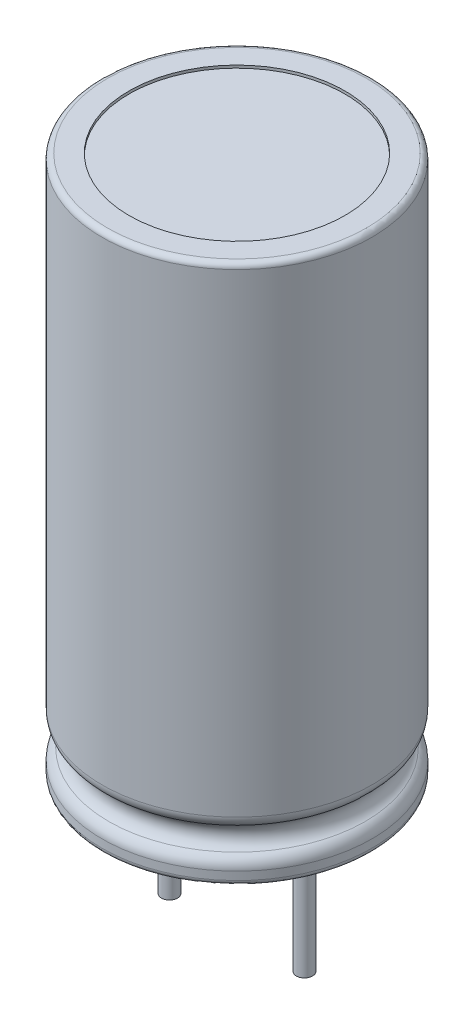
ISO-10303-21;
HEADER;
FILE_DESCRIPTION(('STEP AP214'),'2;1');
FILE_NAME('part.step','',(''),(''),'','','');
FILE_SCHEMA(('AUTOMOTIVE_DESIGN { 1 0 10303 214 1 1 1 1 }'));
ENDSEC;
DATA;
#1=APPLICATION_CONTEXT('core data for automotive mechanical design processes');
#2=APPLICATION_PROTOCOL_DEFINITION('international standard','automotive_design',2000,#1);
#3=PRODUCT_CONTEXT('',#1,'mechanical');
#4=PRODUCT('Part','Part','',(#3));
#5=PRODUCT_RELATED_PRODUCT_CATEGORY('part','',(#4));
#6=PRODUCT_DEFINITION_FORMATION('','',#4);
#7=PRODUCT_DEFINITION_CONTEXT('part definition',#1,'design');
#8=PRODUCT_DEFINITION('design','',#6,#7);
#9=PRODUCT_DEFINITION_SHAPE('','',#8);
#10=(LENGTH_UNIT() NAMED_UNIT(*) SI_UNIT(.MILLI.,.METRE.));
#11=(NAMED_UNIT(*) PLANE_ANGLE_UNIT() SI_UNIT($,.RADIAN.));
#12=(NAMED_UNIT(*) SI_UNIT($,.STERADIAN.) SOLID_ANGLE_UNIT());
#13=UNCERTAINTY_MEASURE_WITH_UNIT(LENGTH_MEASURE(1.E-05),#10,'distance_accuracy_value','');
#14=(GEOMETRIC_REPRESENTATION_CONTEXT(3) GLOBAL_UNCERTAINTY_ASSIGNED_CONTEXT((#13)) GLOBAL_UNIT_ASSIGNED_CONTEXT((#10,
#11,#12)) REPRESENTATION_CONTEXT('',''));
#15=CARTESIAN_POINT('',(0.,0.,0.));
#16=DIRECTION('',(0.,0.,1.));
#17=DIRECTION('',(1.,0.,0.));
#18=AXIS2_PLACEMENT_3D('',#15,#16,#17);
#19=CARTESIAN_POINT('',(2.5,-5.,0.));
#20=DIRECTION('',(0.,1.,0.));
#21=DIRECTION('',(0.,0.,1.));
#22=AXIS2_PLACEMENT_3D('',#19,#20,#21);
#23=CYLINDRICAL_SURFACE('',#22,0.3);
#24=CARTESIAN_POINT('',(2.5,-5.,0.));
#25=DIRECTION('',(0.,-1.,0.));
#26=DIRECTION('',(0.,0.,-1.));
#27=AXIS2_PLACEMENT_3D('',#24,#25,#26);
#28=CIRCLE('',#27,0.3);
#29=CARTESIAN_POINT('',(2.5,-5.,-0.299999999999999));
#30=VERTEX_POINT('',#29);
#31=EDGE_CURVE('E11',#30,#30,#28,.T.);
#32=ORIENTED_EDGE('',*,*,#31,.F.);
#33=EDGE_LOOP('',(#32));
#34=FACE_BOUND('',#33,.T.);
#35=CARTESIAN_POINT('',(2.5,5.,0.));
#36=DIRECTION('',(0.,-1.,0.));
#37=DIRECTION('',(0.,0.,-1.));
#38=AXIS2_PLACEMENT_3D('',#35,#36,#37);
#39=CIRCLE('',#38,0.3);
#40=CARTESIAN_POINT('',(2.5,5.,-0.299999999999999));
#41=VERTEX_POINT('',#40);
#42=EDGE_CURVE('E43',#41,#41,#39,.T.);
#43=ORIENTED_EDGE('',*,*,#42,.T.);
#44=EDGE_LOOP('',(#43));
#45=FACE_BOUND('',#44,.T.);
#46=ADVANCED_FACE('F40',(#34,#45),#23,.T.);
#47=CARTESIAN_POINT('',(2.5,-5.,0.));
#48=DIRECTION('',(0.,-1.,0.));
#49=DIRECTION('',(0.,0.,-1.));
#50=AXIS2_PLACEMENT_3D('',#47,#48,#49);
#51=PLANE('',#50);
#52=ORIENTED_EDGE('',*,*,#31,.T.);
#53=EDGE_LOOP('',(#52));
#54=FACE_BOUND('',#53,.T.);
#55=ADVANCED_FACE('F55',(#54),#51,.T.);
#56=CARTESIAN_POINT('',(2.5,5.,0.));
#57=DIRECTION('',(0.,-1.,0.));
#58=DIRECTION('',(0.,0.,-1.));
#59=AXIS2_PLACEMENT_3D('',#56,#57,#58);
#60=PLANE('',#59);
#61=ORIENTED_EDGE('',*,*,#42,.F.);
#62=EDGE_LOOP('',(#61));
#63=FACE_BOUND('',#62,.T.);
#64=ADVANCED_FACE('F53',(#63),#60,.F.);
#65=CLOSED_SHELL('',(#46,#55,#64));
#66=MANIFOLD_SOLID_BREP('B2',#65);
#67=CARTESIAN_POINT('',(-2.5,-5.,0.));
#68=DIRECTION('',(0.,1.,0.));
#69=DIRECTION('',(0.,0.,1.));
#70=AXIS2_PLACEMENT_3D('',#67,#68,#69);
#71=CYLINDRICAL_SURFACE('',#70,0.3);
#72=CARTESIAN_POINT('',(-2.5,-5.,0.));
#73=DIRECTION('',(0.,-1.,0.));
#74=DIRECTION('',(0.,0.,-1.));
#75=AXIS2_PLACEMENT_3D('',#72,#73,#74);
#76=CIRCLE('',#75,0.3);
#77=CARTESIAN_POINT('',(-2.5,-5.,-0.300000000000001));
#78=VERTEX_POINT('',#77);
#79=EDGE_CURVE('E39',#78,#78,#76,.T.);
#80=ORIENTED_EDGE('',*,*,#79,.F.);
#81=EDGE_LOOP('',(#80));
#82=FACE_BOUND('',#81,.T.);
#83=CARTESIAN_POINT('',(-2.5,5.,0.));
#84=DIRECTION('',(0.,-1.,0.));
#85=DIRECTION('',(0.,0.,-1.));
#86=AXIS2_PLACEMENT_3D('',#83,#84,#85);
#87=CIRCLE('',#86,0.3);
#88=CARTESIAN_POINT('',(-2.5,5.,-0.300000000000001));
#89=VERTEX_POINT('',#88);
#90=EDGE_CURVE('E91',#89,#89,#87,.T.);
#91=ORIENTED_EDGE('',*,*,#90,.T.);
#92=EDGE_LOOP('',(#91));
#93=FACE_BOUND('',#92,.T.);
#94=ADVANCED_FACE('F88',(#82,#93),#71,.T.);
#95=CARTESIAN_POINT('',(-2.5,-5.,0.));
#96=DIRECTION('',(0.,-1.,0.));
#97=DIRECTION('',(0.,0.,-1.));
#98=AXIS2_PLACEMENT_3D('',#95,#96,#97);
#99=PLANE('',#98);
#100=ORIENTED_EDGE('',*,*,#79,.T.);
#101=EDGE_LOOP('',(#100));
#102=FACE_BOUND('',#101,.T.);
#103=ADVANCED_FACE('F103',(#102),#99,.T.);
#104=CARTESIAN_POINT('',(-2.5,5.,0.));
#105=DIRECTION('',(0.,-1.,0.));
#106=DIRECTION('',(0.,0.,-1.));
#107=AXIS2_PLACEMENT_3D('',#104,#105,#106);
#108=PLANE('',#107);
#109=ORIENTED_EDGE('',*,*,#90,.F.);
#110=EDGE_LOOP('',(#109));
#111=FACE_BOUND('',#110,.T.);
#112=ADVANCED_FACE('F101',(#111),#108,.F.);
#113=CLOSED_SHELL('',(#94,#103,#112));
#114=MANIFOLD_SOLID_BREP('B6',#113);
#115=CARTESIAN_POINT('',(-5.,0.,0.));
#116=DIRECTION('',(0.,1.,0.));
#117=DIRECTION('',(0.,0.,1.));
#118=AXIS2_PLACEMENT_3D('',#115,#116,#117);
#119=PLANE('',#118);
#120=CARTESIAN_POINT('',(0.,0.,0.));
#121=DIRECTION('',(0.,-1.,0.));
#122=DIRECTION('',(0.,0.,-1.));
#123=AXIS2_PLACEMENT_3D('',#120,#121,#122);
#124=CIRCLE('',#123,4.);
#125=CARTESIAN_POINT('',(0.,0.,-4.));
#126=VERTEX_POINT('',#125);
#127=EDGE_CURVE('E167',#126,#126,#124,.T.);
#128=ORIENTED_EDGE('',*,*,#127,.F.);
#129=EDGE_LOOP('',(#128));
#130=FACE_BOUND('',#129,.T.);
#131=CARTESIAN_POINT('',(0.,0.,0.));
#132=DIRECTION('',(0.,1.,0.));
#133=DIRECTION('',(0.,0.,1.));
#134=AXIS2_PLACEMENT_3D('',#131,#132,#133);
#135=CIRCLE('',#134,4.8);
#136=CARTESIAN_POINT('',(0.,0.,4.8));
#137=VERTEX_POINT('',#136);
#138=EDGE_CURVE('E143',#137,#137,#135,.F.);
#139=ORIENTED_EDGE('',*,*,#138,.T.);
#140=EDGE_LOOP('',(#139));
#141=FACE_BOUND('',#140,.T.);
#142=ADVANCED_FACE('F128',(#130,#141),#119,.F.);
#143=CARTESIAN_POINT('',(0.,20.,0.));
#144=DIRECTION('',(0.,-1.,0.));
#145=DIRECTION('',(0.,0.,-1.));
#146=AXIS2_PLACEMENT_3D('',#143,#144,#145);
#147=PLANE('',#146);
#148=CARTESIAN_POINT('',(0.,20.,0.));
#149=DIRECTION('',(0.,1.,0.));
#150=DIRECTION('',(0.,0.,1.));
#151=AXIS2_PLACEMENT_3D('',#148,#149,#150);
#152=CIRCLE('',#151,4.);
#153=CARTESIAN_POINT('',(0.,20.,4.));
#154=VERTEX_POINT('',#153);
#155=EDGE_CURVE('E161',#154,#154,#152,.T.);
#156=ORIENTED_EDGE('',*,*,#155,.F.);
#157=EDGE_LOOP('',(#156));
#158=FACE_BOUND('',#157,.T.);
#159=CARTESIAN_POINT('',(0.,20.,0.));
#160=DIRECTION('',(0.,-1.,0.));
#161=DIRECTION('',(0.,0.,-1.));
#162=AXIS2_PLACEMENT_3D('',#159,#160,#161);
#163=CIRCLE('',#162,4.8);
#164=CARTESIAN_POINT('',(0.,20.,-4.8));
#165=VERTEX_POINT('',#164);
#166=EDGE_CURVE('E87',#165,#165,#163,.F.);
#167=ORIENTED_EDGE('',*,*,#166,.T.);
#168=EDGE_LOOP('',(#167));
#169=FACE_BOUND('',#168,.T.);
#170=ADVANCED_FACE('F184',(#158,#169),#147,.F.);
#171=CARTESIAN_POINT('',(0.,0.,0.));
#172=DIRECTION('',(0.,-1.,0.));
#173=DIRECTION('',(0.,0.,-1.));
#174=AXIS2_PLACEMENT_3D('',#171,#172,#173);
#175=CYLINDRICAL_SURFACE('',#174,5.);
#176=CARTESIAN_POINT('',(0.,19.8,0.));
#177=DIRECTION('',(0.,-1.,0.));
#178=DIRECTION('',(0.,0.,-1.));
#179=AXIS2_PLACEMENT_3D('',#176,#177,#178);
#180=CIRCLE('',#179,5.);
#181=CARTESIAN_POINT('',(0.,19.8,-5.));
#182=VERTEX_POINT('',#181);
#183=EDGE_CURVE('E135',#182,#182,#180,.T.);
#184=ORIENTED_EDGE('',*,*,#183,.T.);
#185=EDGE_LOOP('',(#184));
#186=FACE_BOUND('',#185,.T.);
#187=CARTESIAN_POINT('',(0.,2.23205080756888,0.));
#188=DIRECTION('',(0.,-1.,0.));
#189=DIRECTION('',(0.,0.,-1.));
#190=AXIS2_PLACEMENT_3D('',#187,#188,#189);
#191=CIRCLE('',#190,5.);
#192=CARTESIAN_POINT('',(0.,2.23205080756888,-5.));
#193=VERTEX_POINT('',#192);
#194=EDGE_CURVE('E148',#193,#193,#191,.T.);
#195=ORIENTED_EDGE('',*,*,#194,.F.);
#196=EDGE_LOOP('',(#195));
#197=FACE_BOUND('',#196,.T.);
#198=ADVANCED_FACE('F205',(#186,#197),#175,.T.);
#199=CARTESIAN_POINT('',(0.,2.23205080756888,0.));
#200=DIRECTION('',(0.,-1.,0.));
#201=DIRECTION('',(0.,0.,-1.));
#202=AXIS2_PLACEMENT_3D('',#199,#200,#201);
#203=TOROIDAL_SURFACE('',#202,4.5,0.5);
#204=CARTESIAN_POINT('',(0.,1.79903810567666,0.));
#205=DIRECTION('',(0.,-1.,0.));
#206=DIRECTION('',(0.,0.,-1.));
#207=AXIS2_PLACEMENT_3D('',#204,#205,#206);
#208=CIRCLE('',#207,4.75);
#209=CARTESIAN_POINT('',(0.,1.79903810567666,-4.75));
#210=VERTEX_POINT('',#209);
#211=EDGE_CURVE('E151',#210,#210,#208,.T.);
#212=ORIENTED_EDGE('',*,*,#211,.F.);
#213=EDGE_LOOP('',(#212));
#214=FACE_BOUND('',#213,.T.);
#215=ORIENTED_EDGE('',*,*,#194,.T.);
#216=EDGE_LOOP('',(#215));
#217=FACE_BOUND('',#216,.T.);
#218=ADVANCED_FACE('F209',(#214,#217),#203,.T.);
#219=CARTESIAN_POINT('',(0.,1.36602540378444,0.));
#220=DIRECTION('',(0.,-1.,0.));
#221=DIRECTION('',(0.,0.,-1.));
#222=AXIS2_PLACEMENT_3D('',#219,#220,#221);
#223=TOROIDAL_SURFACE('',#222,5.,0.5);
#224=CARTESIAN_POINT('',(0.,0.933012701892219,0.));
#225=DIRECTION('',(0.,-1.,0.));
#226=DIRECTION('',(0.,0.,-1.));
#227=AXIS2_PLACEMENT_3D('',#224,#225,#226);
#228=CIRCLE('',#227,4.75);
#229=CARTESIAN_POINT('',(0.,0.933012701892219,-4.75));
#230=VERTEX_POINT('',#229);
#231=EDGE_CURVE('E154',#230,#230,#228,.T.);
#232=ORIENTED_EDGE('',*,*,#231,.F.);
#233=EDGE_LOOP('',(#232));
#234=FACE_BOUND('',#233,.T.);
#235=ORIENTED_EDGE('',*,*,#211,.T.);
#236=EDGE_LOOP('',(#235));
#237=FACE_BOUND('',#236,.T.);
#238=ADVANCED_FACE('F212',(#234,#237),#223,.F.);
#239=CARTESIAN_POINT('',(0.,0.5,0.));
#240=DIRECTION('',(0.,-1.,0.));
#241=DIRECTION('',(0.,0.,-1.));
#242=AXIS2_PLACEMENT_3D('',#239,#240,#241);
#243=TOROIDAL_SURFACE('',#242,4.5,0.5);
#244=CARTESIAN_POINT('',(0.,0.5,0.));
#245=DIRECTION('',(0.,-1.,0.));
#246=DIRECTION('',(0.,0.,-1.));
#247=AXIS2_PLACEMENT_3D('',#244,#245,#246);
#248=CIRCLE('',#247,5.);
#249=CARTESIAN_POINT('',(0.,0.5,-5.));
#250=VERTEX_POINT('',#249);
#251=EDGE_CURVE('E157',#250,#250,#248,.T.);
#252=ORIENTED_EDGE('',*,*,#251,.F.);
#253=EDGE_LOOP('',(#252));
#254=FACE_BOUND('',#253,.T.);
#255=ORIENTED_EDGE('',*,*,#231,.T.);
#256=EDGE_LOOP('',(#255));
#257=FACE_BOUND('',#256,.T.);
#258=ADVANCED_FACE('F198',(#254,#257),#243,.T.);
#259=CARTESIAN_POINT('',(0.,0.,0.));
#260=DIRECTION('',(0.,-1.,0.));
#261=DIRECTION('',(0.,0.,-1.));
#262=AXIS2_PLACEMENT_3D('',#259,#260,#261);
#263=CYLINDRICAL_SURFACE('',#262,5.);
#264=CARTESIAN_POINT('',(0.,0.2,0.));
#265=DIRECTION('',(0.,1.,0.));
#266=DIRECTION('',(0.,0.,1.));
#267=AXIS2_PLACEMENT_3D('',#264,#265,#266);
#268=CIRCLE('',#267,5.);
#269=CARTESIAN_POINT('',(0.,0.2,5.));
#270=VERTEX_POINT('',#269);
#271=EDGE_CURVE('E139',#270,#270,#268,.T.);
#272=ORIENTED_EDGE('',*,*,#271,.T.);
#273=EDGE_LOOP('',(#272));
#274=FACE_BOUND('',#273,.T.);
#275=ORIENTED_EDGE('',*,*,#251,.T.);
#276=EDGE_LOOP('',(#275));
#277=FACE_BOUND('',#276,.T.);
#278=ADVANCED_FACE('F190',(#274,#277),#263,.T.);
#279=CARTESIAN_POINT('',(0.,0.2,0.));
#280=DIRECTION('',(0.,1.,0.));
#281=DIRECTION('',(0.,0.,1.));
#282=AXIS2_PLACEMENT_3D('',#279,#280,#281);
#283=TOROIDAL_SURFACE('',#282,4.8,0.2);
#284=ORIENTED_EDGE('',*,*,#271,.F.);
#285=EDGE_LOOP('',(#284));
#286=FACE_BOUND('',#285,.T.);
#287=ORIENTED_EDGE('',*,*,#138,.F.);
#288=EDGE_LOOP('',(#287));
#289=FACE_BOUND('',#288,.T.);
#290=ADVANCED_FACE('F188',(#286,#289),#283,.T.);
#291=CARTESIAN_POINT('',(0.,19.8,0.));
#292=DIRECTION('',(0.,-1.,0.));
#293=DIRECTION('',(0.,0.,-1.));
#294=AXIS2_PLACEMENT_3D('',#291,#292,#293);
#295=TOROIDAL_SURFACE('',#294,4.8,0.2);
#296=ORIENTED_EDGE('',*,*,#166,.F.);
#297=EDGE_LOOP('',(#296));
#298=FACE_BOUND('',#297,.T.);
#299=ORIENTED_EDGE('',*,*,#183,.F.);
#300=EDGE_LOOP('',(#299));
#301=FACE_BOUND('',#300,.T.);
#302=ADVANCED_FACE('F130',(#298,#301),#295,.T.);
#303=CARTESIAN_POINT('',(0.,19.9,0.));
#304=DIRECTION('',(0.,1.,0.));
#305=DIRECTION('',(0.,0.,1.));
#306=AXIS2_PLACEMENT_3D('',#303,#304,#305);
#307=CYLINDRICAL_SURFACE('',#306,4.);
#308=CARTESIAN_POINT('',(0.,19.9,0.));
#309=DIRECTION('',(0.,1.,0.));
#310=DIRECTION('',(0.,0.,1.));
#311=AXIS2_PLACEMENT_3D('',#308,#309,#310);
#312=CIRCLE('',#311,4.);
#313=CARTESIAN_POINT('',(0.,19.9,4.));
#314=VERTEX_POINT('',#313);
#315=EDGE_CURVE('E160',#314,#314,#312,.T.);
#316=ORIENTED_EDGE('',*,*,#315,.F.);
#317=EDGE_LOOP('',(#316));
#318=FACE_BOUND('',#317,.T.);
#319=ORIENTED_EDGE('',*,*,#155,.T.);
#320=EDGE_LOOP('',(#319));
#321=FACE_BOUND('',#320,.T.);
#322=ADVANCED_FACE('F196',(#318,#321),#307,.F.);
#323=CARTESIAN_POINT('',(0.,19.9,0.));
#324=DIRECTION('',(0.,1.,0.));
#325=DIRECTION('',(0.,0.,1.));
#326=AXIS2_PLACEMENT_3D('',#323,#324,#325);
#327=PLANE('',#326);
#328=ORIENTED_EDGE('',*,*,#315,.T.);
#329=EDGE_LOOP('',(#328));
#330=FACE_BOUND('',#329,.T.);
#331=ADVANCED_FACE('F178',(#330),#327,.T.);
#332=CARTESIAN_POINT('',(0.,0.1,0.));
#333=DIRECTION('',(0.,-1.,0.));
#334=DIRECTION('',(0.,0.,-1.));
#335=AXIS2_PLACEMENT_3D('',#332,#333,#334);
#336=CYLINDRICAL_SURFACE('',#335,4.);
#337=CARTESIAN_POINT('',(0.,0.1,0.));
#338=DIRECTION('',(0.,-1.,0.));
#339=DIRECTION('',(0.,0.,-1.));
#340=AXIS2_PLACEMENT_3D('',#337,#338,#339);
#341=CIRCLE('',#340,4.);
#342=CARTESIAN_POINT('',(0.,0.1,-4.));
#343=VERTEX_POINT('',#342);
#344=EDGE_CURVE('E164',#343,#343,#341,.T.);
#345=ORIENTED_EDGE('',*,*,#344,.F.);
#346=EDGE_LOOP('',(#345));
#347=FACE_BOUND('',#346,.T.);
#348=ORIENTED_EDGE('',*,*,#127,.T.);
#349=EDGE_LOOP('',(#348));
#350=FACE_BOUND('',#349,.T.);
#351=ADVANCED_FACE('F175',(#347,#350),#336,.F.);
#352=CARTESIAN_POINT('',(0.,0.1,0.));
#353=DIRECTION('',(0.,-1.,0.));
#354=DIRECTION('',(0.,0.,-1.));
#355=AXIS2_PLACEMENT_3D('',#352,#353,#354);
#356=PLANE('',#355);
#357=ORIENTED_EDGE('',*,*,#344,.T.);
#358=EDGE_LOOP('',(#357));
#359=FACE_BOUND('',#358,.T.);
#360=ADVANCED_FACE('F173',(#359),#356,.T.);
#361=CLOSED_SHELL('',(#142,#170,#198,#218,#238,#258,#278,#290,#302,#322,#331,#351,#360));
#362=MANIFOLD_SOLID_BREP('B34',#361);
#363=ADVANCED_BREP_SHAPE_REPRESENTATION('',(#18,#66,#114,#362),#14);
#364=SHAPE_DEFINITION_REPRESENTATION(#9,#363);
ENDSEC;
END-ISO-10303-21;
